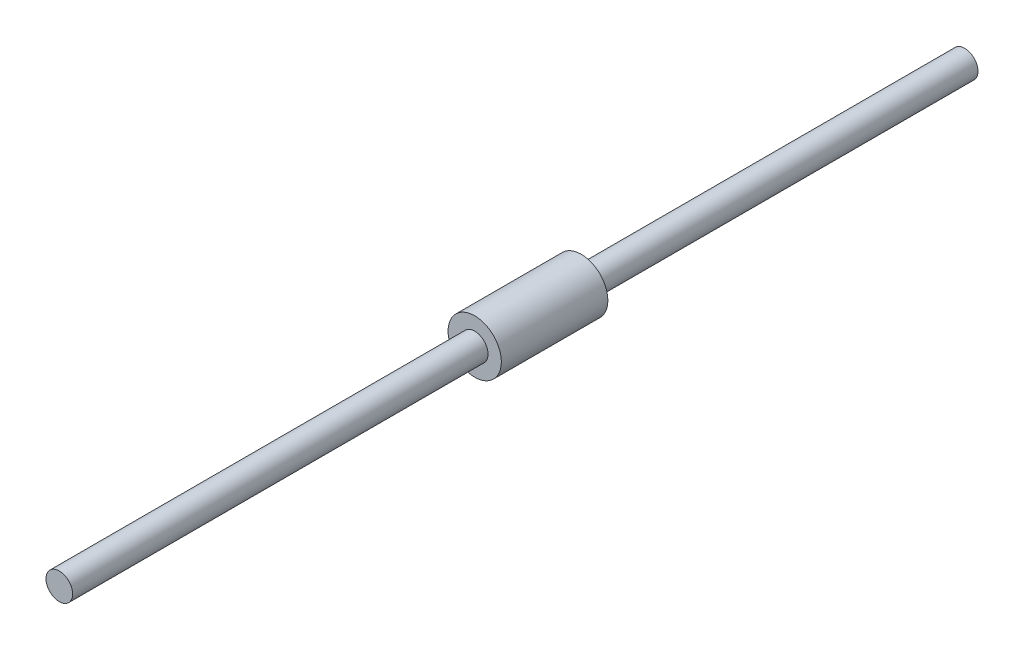
ISO-10303-21;
HEADER;
FILE_DESCRIPTION(('STEP AP214'),'2;1');
FILE_NAME('part.step','',(''),(''),'','','');
FILE_SCHEMA(('AUTOMOTIVE_DESIGN { 1 0 10303 214 1 1 1 1 }'));
ENDSEC;
DATA;
#1=APPLICATION_CONTEXT('core data for automotive mechanical design processes');
#2=APPLICATION_PROTOCOL_DEFINITION('international standard','automotive_design',2000,#1);
#3=PRODUCT_CONTEXT('',#1,'mechanical');
#4=PRODUCT('Part','Part','',(#3));
#5=PRODUCT_RELATED_PRODUCT_CATEGORY('part','',(#4));
#6=PRODUCT_DEFINITION_FORMATION('','',#4);
#7=PRODUCT_DEFINITION_CONTEXT('part definition',#1,'design');
#8=PRODUCT_DEFINITION('design','',#6,#7);
#9=PRODUCT_DEFINITION_SHAPE('','',#8);
#10=(LENGTH_UNIT() NAMED_UNIT(*) SI_UNIT(.MILLI.,.METRE.));
#11=(NAMED_UNIT(*) PLANE_ANGLE_UNIT() SI_UNIT($,.RADIAN.));
#12=(NAMED_UNIT(*) SI_UNIT($,.STERADIAN.) SOLID_ANGLE_UNIT());
#13=UNCERTAINTY_MEASURE_WITH_UNIT(LENGTH_MEASURE(1.E-05),#10,'distance_accuracy_value','');
#14=(GEOMETRIC_REPRESENTATION_CONTEXT(3) GLOBAL_UNCERTAINTY_ASSIGNED_CONTEXT((#13)) GLOBAL_UNIT_ASSIGNED_CONTEXT((#10,
#11,#12)) REPRESENTATION_CONTEXT('',''));
#15=CARTESIAN_POINT('',(0.,0.,0.));
#16=DIRECTION('',(0.,0.,1.));
#17=DIRECTION('',(1.,0.,0.));
#18=AXIS2_PLACEMENT_3D('',#15,#16,#17);
#19=CARTESIAN_POINT('',(0.,0.,-50.));
#20=DIRECTION('',(0.,0.,1.));
#21=DIRECTION('',(1.,0.,0.));
#22=AXIS2_PLACEMENT_3D('',#19,#20,#21);
#23=CYLINDRICAL_SURFACE('',#22,25.);
#24=CARTESIAN_POINT('',(0.,0.,-50.));
#25=DIRECTION('',(0.,0.,1.));
#26=DIRECTION('',(1.,0.,0.));
#27=AXIS2_PLACEMENT_3D('',#24,#25,#26);
#28=CIRCLE('',#27,25.);
#29=CARTESIAN_POINT('',(25.,0.,-50.));
#30=VERTEX_POINT('',#29);
#31=EDGE_CURVE('E13',#30,#30,#28,.T.);
#32=ORIENTED_EDGE('',*,*,#31,.T.);
#33=EDGE_LOOP('',(#32));
#34=FACE_BOUND('',#33,.T.);
#35=CARTESIAN_POINT('',(0.,0.,50.));
#36=DIRECTION('',(0.,0.,1.));
#37=DIRECTION('',(1.,0.,0.));
#38=AXIS2_PLACEMENT_3D('',#35,#36,#37);
#39=CIRCLE('',#38,25.);
#40=CARTESIAN_POINT('',(25.,0.,50.));
#41=VERTEX_POINT('',#40);
#42=EDGE_CURVE('E68',#41,#41,#39,.T.);
#43=ORIENTED_EDGE('',*,*,#42,.F.);
#44=EDGE_LOOP('',(#43));
#45=FACE_BOUND('',#44,.T.);
#46=ADVANCED_FACE('F61',(#34,#45),#23,.T.);
#47=CARTESIAN_POINT('',(0.,0.,-50.));
#48=DIRECTION('',(0.,0.,1.));
#49=DIRECTION('',(1.,0.,0.));
#50=AXIS2_PLACEMENT_3D('',#47,#48,#49);
#51=PLANE('',#50);
#52=CARTESIAN_POINT('',(0.,0.,-50.));
#53=DIRECTION('',(0.,0.,1.));
#54=DIRECTION('',(1.,0.,0.));
#55=AXIS2_PLACEMENT_3D('',#52,#53,#54);
#56=CIRCLE('',#55,12.5);
#57=CARTESIAN_POINT('',(12.5,0.,-50.));
#58=VERTEX_POINT('',#57);
#59=EDGE_CURVE('E78',#58,#58,#56,.T.);
#60=ORIENTED_EDGE('',*,*,#59,.T.);
#61=EDGE_LOOP('',(#60));
#62=FACE_BOUND('',#61,.T.);
#63=ORIENTED_EDGE('',*,*,#31,.F.);
#64=EDGE_LOOP('',(#63));
#65=FACE_BOUND('',#64,.T.);
#66=ADVANCED_FACE('F111',(#62,#65),#51,.F.);
#67=CARTESIAN_POINT('',(0.,0.,50.));
#68=DIRECTION('',(0.,0.,1.));
#69=DIRECTION('',(1.,0.,0.));
#70=AXIS2_PLACEMENT_3D('',#67,#68,#69);
#71=PLANE('',#70);
#72=ORIENTED_EDGE('',*,*,#42,.T.);
#73=EDGE_LOOP('',(#72));
#74=FACE_BOUND('',#73,.T.);
#75=CARTESIAN_POINT('',(0.,0.,50.));
#76=DIRECTION('',(0.,0.,1.));
#77=DIRECTION('',(1.,0.,0.));
#78=AXIS2_PLACEMENT_3D('',#75,#76,#77);
#79=CIRCLE('',#78,12.5);
#80=CARTESIAN_POINT('',(12.5,0.,50.));
#81=VERTEX_POINT('',#80);
#82=EDGE_CURVE('E73',#81,#81,#79,.T.);
#83=ORIENTED_EDGE('',*,*,#82,.F.);
#84=EDGE_LOOP('',(#83));
#85=FACE_BOUND('',#84,.T.);
#86=ADVANCED_FACE('F106',(#74,#85),#71,.T.);
#87=CARTESIAN_POINT('',(0.,0.,440.));
#88=DIRECTION('',(0.,0.,1.));
#89=DIRECTION('',(1.,0.,0.));
#90=AXIS2_PLACEMENT_3D('',#87,#88,#89);
#91=PLANE('',#90);
#92=CARTESIAN_POINT('',(0.,0.,440.));
#93=DIRECTION('',(0.,0.,1.));
#94=DIRECTION('',(1.,0.,0.));
#95=AXIS2_PLACEMENT_3D('',#92,#93,#94);
#96=CIRCLE('',#95,12.5);
#97=CARTESIAN_POINT('',(12.5,0.,440.));
#98=VERTEX_POINT('',#97);
#99=EDGE_CURVE('E88',#98,#98,#96,.T.);
#100=ORIENTED_EDGE('',*,*,#99,.T.);
#101=EDGE_LOOP('',(#100));
#102=FACE_BOUND('',#101,.T.);
#103=ADVANCED_FACE('F93',(#102),#91,.T.);
#104=CARTESIAN_POINT('',(0.,0.,-410.));
#105=DIRECTION('',(0.,0.,1.));
#106=DIRECTION('',(1.,0.,0.));
#107=AXIS2_PLACEMENT_3D('',#104,#105,#106);
#108=CYLINDRICAL_SURFACE('',#107,12.5);
#109=ORIENTED_EDGE('',*,*,#82,.T.);
#110=EDGE_LOOP('',(#109));
#111=FACE_BOUND('',#110,.T.);
#112=ORIENTED_EDGE('',*,*,#99,.F.);
#113=EDGE_LOOP('',(#112));
#114=FACE_BOUND('',#113,.T.);
#115=ADVANCED_FACE('F95',(#111,#114),#108,.T.);
#116=CARTESIAN_POINT('',(0.,0.,-410.));
#117=DIRECTION('',(0.,0.,1.));
#118=DIRECTION('',(1.,0.,0.));
#119=AXIS2_PLACEMENT_3D('',#116,#117,#118);
#120=CIRCLE('',#119,12.5);
#121=CARTESIAN_POINT('',(12.5,0.,-410.));
#122=VERTEX_POINT('',#121);
#123=EDGE_CURVE('E84',#122,#122,#120,.T.);
#124=ORIENTED_EDGE('',*,*,#123,.T.);
#125=EDGE_LOOP('',(#124));
#126=FACE_BOUND('',#125,.T.);
#127=ORIENTED_EDGE('',*,*,#59,.F.);
#128=EDGE_LOOP('',(#127));
#129=FACE_BOUND('',#128,.T.);
#130=ADVANCED_FACE('F97',(#126,#129),#108,.T.);
#131=CARTESIAN_POINT('',(0.,0.,-410.));
#132=DIRECTION('',(0.,0.,1.));
#133=DIRECTION('',(1.,0.,0.));
#134=AXIS2_PLACEMENT_3D('',#131,#132,#133);
#135=PLANE('',#134);
#136=ORIENTED_EDGE('',*,*,#123,.F.);
#137=EDGE_LOOP('',(#136));
#138=FACE_BOUND('',#137,.T.);
#139=ADVANCED_FACE('F104',(#138),#135,.F.);
#140=CLOSED_SHELL('',(#46,#66,#86,#103,#115,#130,#139));
#141=MANIFOLD_SOLID_BREP('B2',#140);
#142=ADVANCED_BREP_SHAPE_REPRESENTATION('',(#18,#141),#14);
#143=SHAPE_DEFINITION_REPRESENTATION(#9,#142);
ENDSEC;
END-ISO-10303-21;
